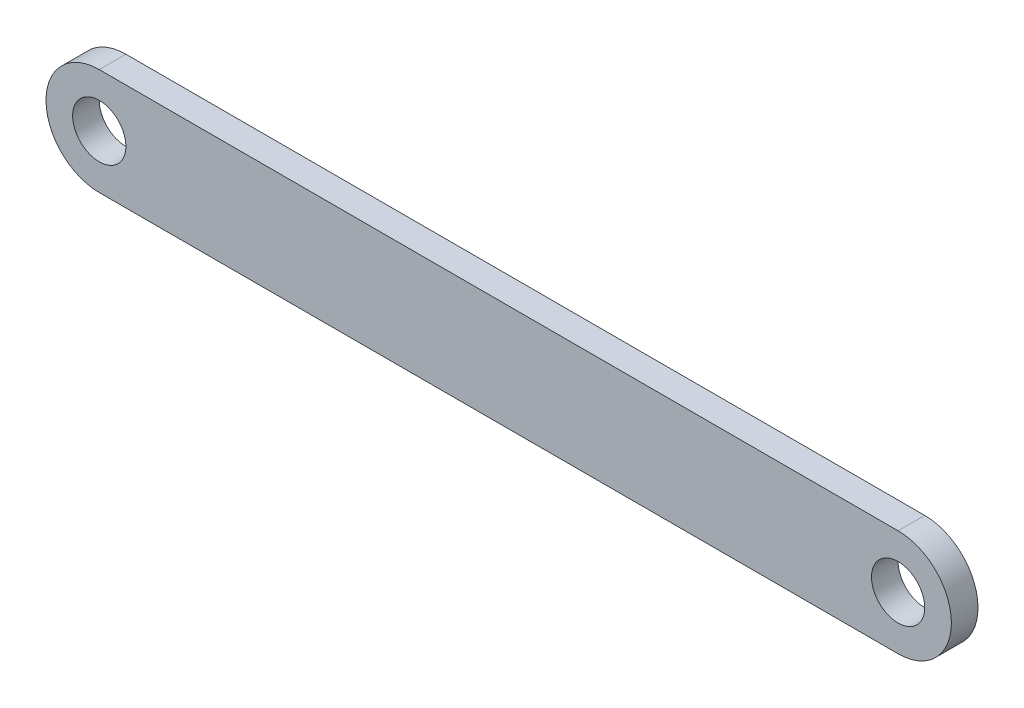
ISO-10303-21;
HEADER;
FILE_DESCRIPTION(('STEP AP214'),'2;1');
FILE_NAME('part.step','',(''),(''),'','','');
FILE_SCHEMA(('AUTOMOTIVE_DESIGN { 1 0 10303 214 1 1 1 1 }'));
ENDSEC;
DATA;
#1=APPLICATION_CONTEXT('core data for automotive mechanical design processes');
#2=APPLICATION_PROTOCOL_DEFINITION('international standard','automotive_design',2000,#1);
#3=PRODUCT_CONTEXT('',#1,'mechanical');
#4=PRODUCT('Part','Part','',(#3));
#5=PRODUCT_RELATED_PRODUCT_CATEGORY('part','',(#4));
#6=PRODUCT_DEFINITION_FORMATION('','',#4);
#7=PRODUCT_DEFINITION_CONTEXT('part definition',#1,'design');
#8=PRODUCT_DEFINITION('design','',#6,#7);
#9=PRODUCT_DEFINITION_SHAPE('','',#8);
#10=(LENGTH_UNIT() NAMED_UNIT(*) SI_UNIT(.MILLI.,.METRE.));
#11=(NAMED_UNIT(*) PLANE_ANGLE_UNIT() SI_UNIT($,.RADIAN.));
#12=(NAMED_UNIT(*) SI_UNIT($,.STERADIAN.) SOLID_ANGLE_UNIT());
#13=UNCERTAINTY_MEASURE_WITH_UNIT(LENGTH_MEASURE(1.E-05),#10,'distance_accuracy_value','');
#14=(GEOMETRIC_REPRESENTATION_CONTEXT(3) GLOBAL_UNCERTAINTY_ASSIGNED_CONTEXT((#13)) GLOBAL_UNIT_ASSIGNED_CONTEXT((#10,
#11,#12)) REPRESENTATION_CONTEXT('',''));
#15=CARTESIAN_POINT('',(0.,0.,0.));
#16=DIRECTION('',(0.,0.,1.));
#17=DIRECTION('',(1.,0.,0.));
#18=AXIS2_PLACEMENT_3D('',#15,#16,#17);
#19=CARTESIAN_POINT('',(0.,-8.80178243774574,2.54));
#20=DIRECTION('',(0.,0.,1.));
#21=DIRECTION('',(1.,0.,0.));
#22=AXIS2_PLACEMENT_3D('',#19,#20,#21);
#23=PLANE('',#22);
#24=CARTESIAN_POINT('',(-76.2,-8.80178243774575,2.54));
#25=DIRECTION('',(0.,0.,1.));
#26=DIRECTION('',(1.,0.,0.));
#27=AXIS2_PLACEMENT_3D('',#24,#25,#26);
#28=CIRCLE('',#27,2.54);
#29=CARTESIAN_POINT('',(-73.66,-8.80178243774575,2.54));
#30=VERTEX_POINT('',#29);
#31=EDGE_CURVE('E101',#30,#30,#28,.T.);
#32=ORIENTED_EDGE('',*,*,#31,.F.);
#33=EDGE_LOOP('',(#32));
#34=FACE_BOUND('',#33,.T.);
#35=CARTESIAN_POINT('',(0.,-8.80178243774574,2.54));
#36=DIRECTION('',(0.,0.,1.));
#37=DIRECTION('',(1.,0.,0.));
#38=AXIS2_PLACEMENT_3D('',#35,#36,#37);
#39=CIRCLE('',#38,5.08);
#40=CARTESIAN_POINT('',(0.,-13.8817824377457,2.54));
#41=VERTEX_POINT('',#40);
#42=CARTESIAN_POINT('',(0.,-3.72178243774574,2.54));
#43=VERTEX_POINT('',#42);
#44=EDGE_CURVE('E86',#41,#43,#39,.T.);
#45=ORIENTED_EDGE('',*,*,#44,.T.);
#46=DIRECTION('',(-1.,0.,0.));
#47=VECTOR('',#46,1.);
#48=CARTESIAN_POINT('',(0.,-3.72178243774574,2.54));
#49=LINE('',#48,#47);
#50=CARTESIAN_POINT('',(-76.2,-3.72178243774576,2.54));
#51=VERTEX_POINT('',#50);
#52=EDGE_CURVE('E81',#43,#51,#49,.T.);
#53=ORIENTED_EDGE('',*,*,#52,.T.);
#54=CARTESIAN_POINT('',(-76.2,-8.80178243774575,2.54));
#55=DIRECTION('',(0.,0.,1.));
#56=DIRECTION('',(1.,0.,0.));
#57=AXIS2_PLACEMENT_3D('',#54,#55,#56);
#58=CIRCLE('',#57,5.08);
#59=CARTESIAN_POINT('',(-76.2,-13.8817824377457,2.54));
#60=VERTEX_POINT('',#59);
#61=EDGE_CURVE('E84',#51,#60,#58,.T.);
#62=ORIENTED_EDGE('',*,*,#61,.T.);
#63=DIRECTION('',(1.,0.,0.));
#64=VECTOR('',#63,1.);
#65=CARTESIAN_POINT('',(0.,-13.8817824377457,2.54));
#66=LINE('',#65,#64);
#67=EDGE_CURVE('E51',#60,#41,#66,.T.);
#68=ORIENTED_EDGE('',*,*,#67,.T.);
#69=EDGE_LOOP('',(#45,#53,#62,#68));
#70=FACE_BOUND('',#69,.T.);
#71=CARTESIAN_POINT('',(0.,-8.80178243774574,2.54));
#72=DIRECTION('',(0.,0.,1.));
#73=DIRECTION('',(1.,0.,0.));
#74=AXIS2_PLACEMENT_3D('',#71,#72,#73);
#75=CIRCLE('',#74,2.54);
#76=CARTESIAN_POINT('',(2.54,-8.80178243774574,2.54));
#77=VERTEX_POINT('',#76);
#78=EDGE_CURVE('E116',#77,#77,#75,.T.);
#79=ORIENTED_EDGE('',*,*,#78,.F.);
#80=EDGE_LOOP('',(#79));
#81=FACE_BOUND('',#80,.T.);
#82=ADVANCED_FACE('F34',(#34,#70,#81),#23,.T.);
#83=CARTESIAN_POINT('',(0.,-8.80178243774574,0.));
#84=DIRECTION('',(0.,0.,1.));
#85=DIRECTION('',(1.,0.,0.));
#86=AXIS2_PLACEMENT_3D('',#83,#84,#85);
#87=PLANE('',#86);
#88=CARTESIAN_POINT('',(0.,-8.80178243774574,0.));
#89=DIRECTION('',(0.,0.,1.));
#90=DIRECTION('',(1.,0.,0.));
#91=AXIS2_PLACEMENT_3D('',#88,#89,#90);
#92=CIRCLE('',#91,5.08);
#93=CARTESIAN_POINT('',(0.,-13.8817824377457,0.));
#94=VERTEX_POINT('',#93);
#95=CARTESIAN_POINT('',(0.,-3.72178243774574,0.));
#96=VERTEX_POINT('',#95);
#97=EDGE_CURVE('E98',#94,#96,#92,.T.);
#98=ORIENTED_EDGE('',*,*,#97,.F.);
#99=DIRECTION('',(1.,0.,0.));
#100=VECTOR('',#99,1.);
#101=CARTESIAN_POINT('',(0.,-13.8817824377457,0.));
#102=LINE('',#101,#100);
#103=CARTESIAN_POINT('',(-76.2,-13.8817824377457,0.));
#104=VERTEX_POINT('',#103);
#105=EDGE_CURVE('E74',#104,#94,#102,.T.);
#106=ORIENTED_EDGE('',*,*,#105,.F.);
#107=CARTESIAN_POINT('',(-76.2,-8.80178243774575,0.));
#108=DIRECTION('',(0.,0.,1.));
#109=DIRECTION('',(1.,0.,0.));
#110=AXIS2_PLACEMENT_3D('',#107,#108,#109);
#111=CIRCLE('',#110,5.08);
#112=CARTESIAN_POINT('',(-76.2,-3.72178243774576,0.));
#113=VERTEX_POINT('',#112);
#114=EDGE_CURVE('E68',#113,#104,#111,.T.);
#115=ORIENTED_EDGE('',*,*,#114,.F.);
#116=DIRECTION('',(-1.,0.,0.));
#117=VECTOR('',#116,1.);
#118=CARTESIAN_POINT('',(0.,-3.72178243774574,0.));
#119=LINE('',#118,#117);
#120=EDGE_CURVE('E90',#96,#113,#119,.T.);
#121=ORIENTED_EDGE('',*,*,#120,.F.);
#122=EDGE_LOOP('',(#98,#106,#115,#121));
#123=FACE_BOUND('',#122,.T.);
#124=CARTESIAN_POINT('',(-76.2,-8.80178243774575,0.));
#125=DIRECTION('',(0.,0.,1.));
#126=DIRECTION('',(1.,0.,0.));
#127=AXIS2_PLACEMENT_3D('',#124,#125,#126);
#128=CIRCLE('',#127,2.54);
#129=CARTESIAN_POINT('',(-73.66,-8.80178243774575,0.));
#130=VERTEX_POINT('',#129);
#131=EDGE_CURVE('E113',#130,#130,#128,.T.);
#132=ORIENTED_EDGE('',*,*,#131,.T.);
#133=EDGE_LOOP('',(#132));
#134=FACE_BOUND('',#133,.T.);
#135=CARTESIAN_POINT('',(0.,-8.80178243774574,0.));
#136=DIRECTION('',(0.,0.,1.));
#137=DIRECTION('',(1.,0.,0.));
#138=AXIS2_PLACEMENT_3D('',#135,#136,#137);
#139=CIRCLE('',#138,2.54);
#140=CARTESIAN_POINT('',(2.54,-8.80178243774574,0.));
#141=VERTEX_POINT('',#140);
#142=EDGE_CURVE('E119',#141,#141,#139,.T.);
#143=ORIENTED_EDGE('',*,*,#142,.T.);
#144=EDGE_LOOP('',(#143));
#145=FACE_BOUND('',#144,.T.);
#146=ADVANCED_FACE('F109',(#123,#134,#145),#87,.F.);
#147=CARTESIAN_POINT('',(0.,-8.80178243774574,2.54));
#148=DIRECTION('',(0.,0.,-1.));
#149=DIRECTION('',(-1.,0.,0.));
#150=AXIS2_PLACEMENT_3D('',#147,#148,#149);
#151=CYLINDRICAL_SURFACE('',#150,5.08);
#152=ORIENTED_EDGE('',*,*,#97,.T.);
#153=DIRECTION('',(0.,0.,-1.));
#154=VECTOR('',#153,1.);
#155=CARTESIAN_POINT('',(0.,-3.72178243774574,2.54));
#156=LINE('',#155,#154);
#157=EDGE_CURVE('E11',#43,#96,#156,.T.);
#158=ORIENTED_EDGE('',*,*,#157,.F.);
#159=ORIENTED_EDGE('',*,*,#44,.F.);
#160=DIRECTION('',(0.,0.,-1.));
#161=VECTOR('',#160,1.);
#162=CARTESIAN_POINT('',(0.,-13.8817824377457,2.54));
#163=LINE('',#162,#161);
#164=EDGE_CURVE('E94',#41,#94,#163,.T.);
#165=ORIENTED_EDGE('',*,*,#164,.T.);
#166=EDGE_LOOP('',(#152,#158,#159,#165));
#167=FACE_BOUND('',#166,.T.);
#168=ADVANCED_FACE('F36',(#167),#151,.T.);
#169=CARTESIAN_POINT('',(0.,-3.72178243774574,2.54));
#170=DIRECTION('',(0.,-1.,0.));
#171=DIRECTION('',(1.,0.,0.));
#172=AXIS2_PLACEMENT_3D('',#169,#170,#171);
#173=PLANE('',#172);
#174=ORIENTED_EDGE('',*,*,#120,.T.);
#175=DIRECTION('',(0.,0.,-1.));
#176=VECTOR('',#175,1.);
#177=CARTESIAN_POINT('',(-76.2,-3.72178243774576,2.54));
#178=LINE('',#177,#176);
#179=EDGE_CURVE('E43',#51,#113,#178,.T.);
#180=ORIENTED_EDGE('',*,*,#179,.F.);
#181=ORIENTED_EDGE('',*,*,#52,.F.);
#182=ORIENTED_EDGE('',*,*,#157,.T.);
#183=EDGE_LOOP('',(#174,#180,#181,#182));
#184=FACE_BOUND('',#183,.T.);
#185=ADVANCED_FACE('F89',(#184),#173,.F.);
#186=CARTESIAN_POINT('',(-76.2,-8.80178243774575,2.54));
#187=DIRECTION('',(0.,0.,-1.));
#188=DIRECTION('',(-1.,0.,0.));
#189=AXIS2_PLACEMENT_3D('',#186,#187,#188);
#190=CYLINDRICAL_SURFACE('',#189,5.08);
#191=ORIENTED_EDGE('',*,*,#114,.T.);
#192=DIRECTION('',(0.,0.,-1.));
#193=VECTOR('',#192,1.);
#194=CARTESIAN_POINT('',(-76.2,-13.8817824377457,2.54));
#195=LINE('',#194,#193);
#196=EDGE_CURVE('E91',#60,#104,#195,.T.);
#197=ORIENTED_EDGE('',*,*,#196,.F.);
#198=ORIENTED_EDGE('',*,*,#61,.F.);
#199=ORIENTED_EDGE('',*,*,#179,.T.);
#200=EDGE_LOOP('',(#191,#197,#198,#199));
#201=FACE_BOUND('',#200,.T.);
#202=ADVANCED_FACE('F92',(#201),#190,.T.);
#203=CARTESIAN_POINT('',(0.,-13.8817824377457,2.54));
#204=DIRECTION('',(0.,1.,0.));
#205=DIRECTION('',(0.,0.,1.));
#206=AXIS2_PLACEMENT_3D('',#203,#204,#205);
#207=PLANE('',#206);
#208=ORIENTED_EDGE('',*,*,#105,.T.);
#209=ORIENTED_EDGE('',*,*,#164,.F.);
#210=ORIENTED_EDGE('',*,*,#67,.F.);
#211=ORIENTED_EDGE('',*,*,#196,.T.);
#212=EDGE_LOOP('',(#208,#209,#210,#211));
#213=FACE_BOUND('',#212,.T.);
#214=ADVANCED_FACE('F106',(#213),#207,.F.);
#215=CARTESIAN_POINT('',(-76.2,-8.80178243774575,2.54));
#216=DIRECTION('',(0.,0.,-1.));
#217=DIRECTION('',(-1.,0.,0.));
#218=AXIS2_PLACEMENT_3D('',#215,#216,#217);
#219=CYLINDRICAL_SURFACE('',#218,2.54);
#220=ORIENTED_EDGE('',*,*,#31,.T.);
#221=EDGE_LOOP('',(#220));
#222=FACE_BOUND('',#221,.T.);
#223=ORIENTED_EDGE('',*,*,#131,.F.);
#224=EDGE_LOOP('',(#223));
#225=FACE_BOUND('',#224,.T.);
#226=ADVANCED_FACE('F136',(#222,#225),#219,.F.);
#227=CARTESIAN_POINT('',(0.,-8.80178243774574,2.54));
#228=DIRECTION('',(0.,0.,-1.));
#229=DIRECTION('',(-1.,0.,0.));
#230=AXIS2_PLACEMENT_3D('',#227,#228,#229);
#231=CYLINDRICAL_SURFACE('',#230,2.54);
#232=ORIENTED_EDGE('',*,*,#78,.T.);
#233=EDGE_LOOP('',(#232));
#234=FACE_BOUND('',#233,.T.);
#235=ORIENTED_EDGE('',*,*,#142,.F.);
#236=EDGE_LOOP('',(#235));
#237=FACE_BOUND('',#236,.T.);
#238=ADVANCED_FACE('F125',(#234,#237),#231,.F.);
#239=CLOSED_SHELL('',(#82,#146,#168,#185,#202,#214,#226,#238));
#240=MANIFOLD_SOLID_BREP('B2',#239);
#241=ADVANCED_BREP_SHAPE_REPRESENTATION('',(#18,#240),#14);
#242=SHAPE_DEFINITION_REPRESENTATION(#9,#241);
ENDSEC;
END-ISO-10303-21;
